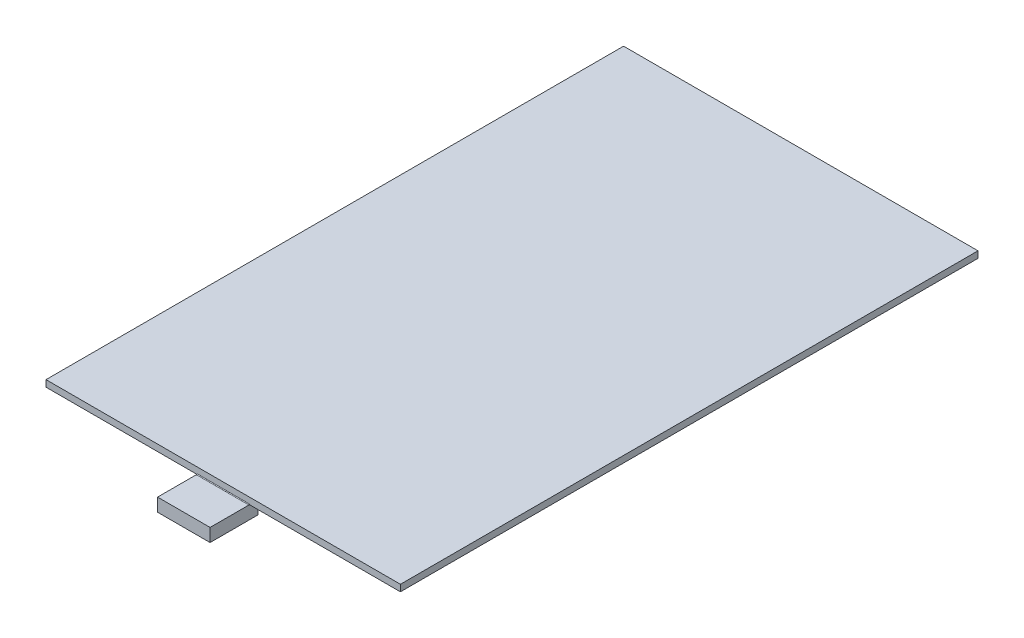
ISO-10303-21;
HEADER;
FILE_DESCRIPTION(('STEP AP214'),'2;1');
FILE_NAME('part.step','',(''),(''),'','','');
FILE_SCHEMA(('AUTOMOTIVE_DESIGN { 1 0 10303 214 1 1 1 1 }'));
ENDSEC;
DATA;
#1=APPLICATION_CONTEXT('core data for automotive mechanical design processes');
#2=APPLICATION_PROTOCOL_DEFINITION('international standard','automotive_design',2000,#1);
#3=PRODUCT_CONTEXT('',#1,'mechanical');
#4=PRODUCT('Part','Part','',(#3));
#5=PRODUCT_RELATED_PRODUCT_CATEGORY('part','',(#4));
#6=PRODUCT_DEFINITION_FORMATION('','',#4);
#7=PRODUCT_DEFINITION_CONTEXT('part definition',#1,'design');
#8=PRODUCT_DEFINITION('design','',#6,#7);
#9=PRODUCT_DEFINITION_SHAPE('','',#8);
#10=(LENGTH_UNIT() NAMED_UNIT(*) SI_UNIT(.MILLI.,.METRE.));
#11=(NAMED_UNIT(*) PLANE_ANGLE_UNIT() SI_UNIT($,.RADIAN.));
#12=(NAMED_UNIT(*) SI_UNIT($,.STERADIAN.) SOLID_ANGLE_UNIT());
#13=UNCERTAINTY_MEASURE_WITH_UNIT(LENGTH_MEASURE(1.E-05),#10,'distance_accuracy_value','');
#14=(GEOMETRIC_REPRESENTATION_CONTEXT(3) GLOBAL_UNCERTAINTY_ASSIGNED_CONTEXT((#13)) GLOBAL_UNIT_ASSIGNED_CONTEXT((#10,
#11,#12)) REPRESENTATION_CONTEXT('',''));
#15=CARTESIAN_POINT('',(0.,0.,0.));
#16=DIRECTION('',(0.,0.,1.));
#17=DIRECTION('',(1.,0.,0.));
#18=AXIS2_PLACEMENT_3D('',#15,#16,#17);
#19=CARTESIAN_POINT('',(0.,0.,0.));
#20=DIRECTION('',(0.,1.,0.));
#21=DIRECTION('',(0.,0.,1.));
#22=AXIS2_PLACEMENT_3D('',#19,#20,#21);
#23=PLANE('',#22);
#24=DIRECTION('',(1.,0.,0.));
#25=VECTOR('',#24,1.);
#26=CARTESIAN_POINT('',(-27.,0.,44.));
#27=LINE('',#26,#25);
#28=CARTESIAN_POINT('',(4.1,0.,44.));
#29=VERTEX_POINT('',#28);
#30=CARTESIAN_POINT('',(27.,0.,44.));
#31=VERTEX_POINT('',#30);
#32=EDGE_CURVE('E173',#29,#31,#27,.T.);
#33=ORIENTED_EDGE('',*,*,#32,.F.);
#34=DIRECTION('',(0.,0.,1.));
#35=VECTOR('',#34,1.);
#36=CARTESIAN_POINT('',(4.1,0.,42.7));
#37=LINE('',#36,#35);
#38=CARTESIAN_POINT('',(4.1,0.,42.6));
#39=VERTEX_POINT('',#38);
#40=EDGE_CURVE('E206',#29,#39,#37,.F.);
#41=ORIENTED_EDGE('',*,*,#40,.T.);
#42=DIRECTION('',(1.,0.,0.));
#43=VECTOR('',#42,1.);
#44=CARTESIAN_POINT('',(-4.,0.,42.6000000000001));
#45=LINE('',#44,#43);
#46=CARTESIAN_POINT('',(-4.09999999999997,0.,42.6000000000001));
#47=VERTEX_POINT('',#46);
#48=EDGE_CURVE('E204',#39,#47,#45,.F.);
#49=ORIENTED_EDGE('',*,*,#48,.T.);
#50=DIRECTION('',(0.,0.,-1.));
#51=VECTOR('',#50,1.);
#52=CARTESIAN_POINT('',(-4.09999999999998,0.,44.));
#53=LINE('',#52,#51);
#54=CARTESIAN_POINT('',(-4.09999999999998,0.,44.));
#55=VERTEX_POINT('',#54);
#56=EDGE_CURVE('E202',#47,#55,#53,.F.);
#57=ORIENTED_EDGE('',*,*,#56,.T.);
#58=CARTESIAN_POINT('',(-27.,0.,44.));
#59=VERTEX_POINT('',#58);
#60=EDGE_CURVE('E163',#59,#55,#27,.T.);
#61=ORIENTED_EDGE('',*,*,#60,.F.);
#62=DIRECTION('',(0.,0.,1.));
#63=VECTOR('',#62,1.);
#64=CARTESIAN_POINT('',(-27.,0.,-44.));
#65=LINE('',#64,#63);
#66=CARTESIAN_POINT('',(-27.,0.,-44.));
#67=VERTEX_POINT('',#66);
#68=EDGE_CURVE('E171',#67,#59,#65,.T.);
#69=ORIENTED_EDGE('',*,*,#68,.F.);
#70=DIRECTION('',(-1.,0.,0.));
#71=VECTOR('',#70,1.);
#72=CARTESIAN_POINT('',(-27.,0.,-44.));
#73=LINE('',#72,#71);
#74=CARTESIAN_POINT('',(27.,0.,-44.));
#75=VERTEX_POINT('',#74);
#76=EDGE_CURVE('E153',#75,#67,#73,.T.);
#77=ORIENTED_EDGE('',*,*,#76,.F.);
#78=DIRECTION('',(0.,0.,-1.));
#79=VECTOR('',#78,1.);
#80=CARTESIAN_POINT('',(27.,0.,-44.));
#81=LINE('',#80,#79);
#82=EDGE_CURVE('E150',#31,#75,#81,.T.);
#83=ORIENTED_EDGE('',*,*,#82,.F.);
#84=EDGE_LOOP('',(#33,#41,#49,#57,#61,#69,#77,#83));
#85=FACE_BOUND('',#84,.T.);
#86=ADVANCED_FACE('F34',(#85),#23,.F.);
#87=CARTESIAN_POINT('',(27.,1.,-44.));
#88=DIRECTION('',(-1.,0.,0.));
#89=DIRECTION('',(0.,0.,1.));
#90=AXIS2_PLACEMENT_3D('',#87,#88,#89);
#91=PLANE('',#90);
#92=ORIENTED_EDGE('',*,*,#82,.T.);
#93=DIRECTION('',(0.,-1.,0.));
#94=VECTOR('',#93,1.);
#95=CARTESIAN_POINT('',(27.,1.,-44.));
#96=LINE('',#95,#94);
#97=CARTESIAN_POINT('',(27.,1.,-44.));
#98=VERTEX_POINT('',#97);
#99=EDGE_CURVE('E184',#98,#75,#96,.T.);
#100=ORIENTED_EDGE('',*,*,#99,.F.);
#101=DIRECTION('',(0.,0.,-1.));
#102=VECTOR('',#101,1.);
#103=CARTESIAN_POINT('',(27.,1.,-44.));
#104=LINE('',#103,#102);
#105=CARTESIAN_POINT('',(27.,1.,44.));
#106=VERTEX_POINT('',#105);
#107=EDGE_CURVE('E159',#106,#98,#104,.T.);
#108=ORIENTED_EDGE('',*,*,#107,.F.);
#109=DIRECTION('',(0.,-1.,0.));
#110=VECTOR('',#109,1.);
#111=CARTESIAN_POINT('',(27.,1.,44.));
#112=LINE('',#111,#110);
#113=EDGE_CURVE('E168',#106,#31,#112,.T.);
#114=ORIENTED_EDGE('',*,*,#113,.T.);
#115=EDGE_LOOP('',(#92,#100,#108,#114));
#116=FACE_BOUND('',#115,.T.);
#117=ADVANCED_FACE('F264',(#116),#91,.F.);
#118=CARTESIAN_POINT('',(-27.,1.,-44.));
#119=DIRECTION('',(0.,0.,1.));
#120=DIRECTION('',(1.,0.,0.));
#121=AXIS2_PLACEMENT_3D('',#118,#119,#120);
#122=PLANE('',#121);
#123=ORIENTED_EDGE('',*,*,#76,.T.);
#124=DIRECTION('',(0.,-1.,0.));
#125=VECTOR('',#124,1.);
#126=CARTESIAN_POINT('',(-27.,1.,-44.));
#127=LINE('',#126,#125);
#128=CARTESIAN_POINT('',(-27.,1.,-44.));
#129=VERTEX_POINT('',#128);
#130=EDGE_CURVE('E181',#129,#67,#127,.T.);
#131=ORIENTED_EDGE('',*,*,#130,.F.);
#132=DIRECTION('',(-1.,0.,0.));
#133=VECTOR('',#132,1.);
#134=CARTESIAN_POINT('',(-27.,1.,-44.));
#135=LINE('',#134,#133);
#136=EDGE_CURVE('E162',#98,#129,#135,.T.);
#137=ORIENTED_EDGE('',*,*,#136,.F.);
#138=ORIENTED_EDGE('',*,*,#99,.T.);
#139=EDGE_LOOP('',(#123,#131,#137,#138));
#140=FACE_BOUND('',#139,.T.);
#141=ADVANCED_FACE('F275',(#140),#122,.F.);
#142=CARTESIAN_POINT('',(-27.,1.,-44.));
#143=DIRECTION('',(1.,0.,0.));
#144=DIRECTION('',(0.,0.,-1.));
#145=AXIS2_PLACEMENT_3D('',#142,#143,#144);
#146=PLANE('',#145);
#147=ORIENTED_EDGE('',*,*,#68,.T.);
#148=DIRECTION('',(0.,-1.,0.));
#149=VECTOR('',#148,1.);
#150=CARTESIAN_POINT('',(-27.,1.,44.));
#151=LINE('',#150,#149);
#152=CARTESIAN_POINT('',(-27.,1.,44.));
#153=VERTEX_POINT('',#152);
#154=EDGE_CURVE('E178',#153,#59,#151,.T.);
#155=ORIENTED_EDGE('',*,*,#154,.F.);
#156=DIRECTION('',(0.,0.,1.));
#157=VECTOR('',#156,1.);
#158=CARTESIAN_POINT('',(-27.,1.,-44.));
#159=LINE('',#158,#157);
#160=EDGE_CURVE('E165',#129,#153,#159,.T.);
#161=ORIENTED_EDGE('',*,*,#160,.F.);
#162=ORIENTED_EDGE('',*,*,#130,.T.);
#163=EDGE_LOOP('',(#147,#155,#161,#162));
#164=FACE_BOUND('',#163,.T.);
#165=ADVANCED_FACE('F273',(#164),#146,.F.);
#166=CARTESIAN_POINT('',(-27.,1.,44.));
#167=DIRECTION('',(0.,0.,-1.));
#168=DIRECTION('',(-1.,0.,0.));
#169=AXIS2_PLACEMENT_3D('',#166,#167,#168);
#170=PLANE('',#169);
#171=DIRECTION('',(1.,0.,0.));
#172=VECTOR('',#171,1.);
#173=CARTESIAN_POINT('',(-27.,0.1,44.));
#174=LINE('',#173,#172);
#175=CARTESIAN_POINT('',(-3.99999999999998,0.1,44.));
#176=VERTEX_POINT('',#175);
#177=CARTESIAN_POINT('',(4.,0.1,44.));
#178=VERTEX_POINT('',#177);
#179=EDGE_CURVE('E188',#176,#178,#174,.T.);
#180=ORIENTED_EDGE('',*,*,#179,.T.);
#181=DIRECTION('',(0.,-1.,0.));
#182=VECTOR('',#181,1.);
#183=CARTESIAN_POINT('',(4.,-2.,44.));
#184=LINE('',#183,#182);
#185=CARTESIAN_POINT('',(4.,-0.1,44.));
#186=VERTEX_POINT('',#185);
#187=EDGE_CURVE('E191',#178,#186,#184,.T.);
#188=ORIENTED_EDGE('',*,*,#187,.T.);
#189=CARTESIAN_POINT('',(4.1,-0.1,44.));
#190=DIRECTION('',(0.,0.,-1.));
#191=DIRECTION('',(-1.,0.,0.));
#192=AXIS2_PLACEMENT_3D('',#189,#190,#191);
#193=CIRCLE('',#192,0.1);
#194=EDGE_CURVE('E43',#186,#29,#193,.T.);
#195=ORIENTED_EDGE('',*,*,#194,.T.);
#196=ORIENTED_EDGE('',*,*,#32,.T.);
#197=ORIENTED_EDGE('',*,*,#113,.F.);
#198=DIRECTION('',(1.,0.,0.));
#199=VECTOR('',#198,1.);
#200=CARTESIAN_POINT('',(-27.,1.,44.));
#201=LINE('',#200,#199);
#202=EDGE_CURVE('E167',#153,#106,#201,.T.);
#203=ORIENTED_EDGE('',*,*,#202,.F.);
#204=ORIENTED_EDGE('',*,*,#154,.T.);
#205=ORIENTED_EDGE('',*,*,#60,.T.);
#206=CARTESIAN_POINT('',(-4.09999999999998,-0.1,44.));
#207=DIRECTION('',(0.,0.,-1.));
#208=DIRECTION('',(-1.,0.,0.));
#209=AXIS2_PLACEMENT_3D('',#206,#207,#208);
#210=CIRCLE('',#209,0.1);
#211=CARTESIAN_POINT('',(-3.99999999999998,-0.1,44.));
#212=VERTEX_POINT('',#211);
#213=EDGE_CURVE('E11',#55,#212,#210,.T.);
#214=ORIENTED_EDGE('',*,*,#213,.T.);
#215=DIRECTION('',(0.,1.,0.));
#216=VECTOR('',#215,1.);
#217=CARTESIAN_POINT('',(-3.99999999999998,-2.,44.));
#218=LINE('',#217,#216);
#219=EDGE_CURVE('E51',#212,#176,#218,.T.);
#220=ORIENTED_EDGE('',*,*,#219,.T.);
#221=EDGE_LOOP('',(#180,#188,#195,#196,#197,#203,#204,#205,#214,#220));
#222=FACE_BOUND('',#221,.T.);
#223=ADVANCED_FACE('F248',(#222),#170,.F.);
#224=CARTESIAN_POINT('',(0.,1.,0.));
#225=DIRECTION('',(0.,1.,0.));
#226=DIRECTION('',(0.,0.,1.));
#227=AXIS2_PLACEMENT_3D('',#224,#225,#226);
#228=PLANE('',#227);
#229=ORIENTED_EDGE('',*,*,#107,.T.);
#230=ORIENTED_EDGE('',*,*,#136,.T.);
#231=ORIENTED_EDGE('',*,*,#160,.T.);
#232=ORIENTED_EDGE('',*,*,#202,.T.);
#233=EDGE_LOOP('',(#229,#230,#231,#232));
#234=FACE_BOUND('',#233,.T.);
#235=ADVANCED_FACE('F269',(#234),#228,.T.);
#236=CARTESIAN_POINT('',(0.,0.,0.));
#237=DIRECTION('',(0.,1.,0.));
#238=DIRECTION('',(0.,0.,1.));
#239=AXIS2_PLACEMENT_3D('',#236,#237,#238);
#240=PLANE('',#239);
#241=DIRECTION('',(0.,0.,1.));
#242=VECTOR('',#241,1.);
#243=CARTESIAN_POINT('',(4.,0.,50.));
#244=LINE('',#243,#242);
#245=CARTESIAN_POINT('',(4.,0.,44.1));
#246=VERTEX_POINT('',#245);
#247=CARTESIAN_POINT('',(4.,0.,50.));
#248=VERTEX_POINT('',#247);
#249=EDGE_CURVE('E218',#246,#248,#244,.T.);
#250=ORIENTED_EDGE('',*,*,#249,.F.);
#251=DIRECTION('',(1.,0.,0.));
#252=VECTOR('',#251,1.);
#253=CARTESIAN_POINT('',(0.,0.,44.1));
#254=LINE('',#253,#252);
#255=CARTESIAN_POINT('',(-3.99999999999998,0.,44.1));
#256=VERTEX_POINT('',#255);
#257=EDGE_CURVE('E193',#246,#256,#254,.F.);
#258=ORIENTED_EDGE('',*,*,#257,.T.);
#259=DIRECTION('',(0.,0.,-1.));
#260=VECTOR('',#259,1.);
#261=CARTESIAN_POINT('',(-3.99999999999998,0.,44.0000000000001));
#262=LINE('',#261,#260);
#263=CARTESIAN_POINT('',(-4.,0.,50.));
#264=VERTEX_POINT('',#263);
#265=EDGE_CURVE('E147',#264,#256,#262,.T.);
#266=ORIENTED_EDGE('',*,*,#265,.F.);
#267=DIRECTION('',(-1.,0.,0.));
#268=VECTOR('',#267,1.);
#269=CARTESIAN_POINT('',(-4.,0.,50.));
#270=LINE('',#269,#268);
#271=EDGE_CURVE('E222',#248,#264,#270,.T.);
#272=ORIENTED_EDGE('',*,*,#271,.F.);
#273=EDGE_LOOP('',(#250,#258,#266,#272));
#274=FACE_BOUND('',#273,.T.);
#275=ADVANCED_FACE('F240',(#274),#240,.T.);
#276=CARTESIAN_POINT('',(-4.,-2.,42.7000000000001));
#277=DIRECTION('',(0.,0.,1.));
#278=DIRECTION('',(1.,0.,0.));
#279=AXIS2_PLACEMENT_3D('',#276,#277,#278);
#280=PLANE('',#279);
#281=DIRECTION('',(0.,1.,0.));
#282=VECTOR('',#281,1.);
#283=CARTESIAN_POINT('',(-4.,-2.,42.7000000000001));
#284=LINE('',#283,#282);
#285=CARTESIAN_POINT('',(-4.,-2.,42.7000000000001));
#286=VERTEX_POINT('',#285);
#287=CARTESIAN_POINT('',(-4.,-0.1,42.7000000000001));
#288=VERTEX_POINT('',#287);
#289=EDGE_CURVE('E132',#286,#288,#284,.T.);
#290=ORIENTED_EDGE('',*,*,#289,.T.);
#291=DIRECTION('',(1.,0.,0.));
#292=VECTOR('',#291,1.);
#293=CARTESIAN_POINT('',(4.,-0.1,42.7));
#294=LINE('',#293,#292);
#295=CARTESIAN_POINT('',(4.,-0.1,42.7));
#296=VERTEX_POINT('',#295);
#297=EDGE_CURVE('E208',#288,#296,#294,.T.);
#298=ORIENTED_EDGE('',*,*,#297,.T.);
#299=DIRECTION('',(0.,1.,0.));
#300=VECTOR('',#299,1.);
#301=CARTESIAN_POINT('',(4.,-2.,42.7));
#302=LINE('',#301,#300);
#303=CARTESIAN_POINT('',(4.,-2.,42.7));
#304=VERTEX_POINT('',#303);
#305=EDGE_CURVE('E135',#304,#296,#302,.T.);
#306=ORIENTED_EDGE('',*,*,#305,.F.);
#307=DIRECTION('',(1.,0.,0.));
#308=VECTOR('',#307,1.);
#309=CARTESIAN_POINT('',(-4.,-2.,42.7000000000001));
#310=LINE('',#309,#308);
#311=EDGE_CURVE('E129',#286,#304,#310,.T.);
#312=ORIENTED_EDGE('',*,*,#311,.F.);
#313=EDGE_LOOP('',(#290,#298,#306,#312));
#314=FACE_BOUND('',#313,.T.);
#315=ADVANCED_FACE('F131',(#314),#280,.F.);
#316=CARTESIAN_POINT('',(4.,-2.,50.));
#317=DIRECTION('',(-1.,0.,0.));
#318=DIRECTION('',(0.,0.,1.));
#319=AXIS2_PLACEMENT_3D('',#316,#317,#318);
#320=PLANE('',#319);
#321=ORIENTED_EDGE('',*,*,#305,.T.);
#322=DIRECTION('',(0.,0.,1.));
#323=VECTOR('',#322,1.);
#324=CARTESIAN_POINT('',(4.,-0.1,44.));
#325=LINE('',#324,#323);
#326=EDGE_CURVE('E199',#296,#186,#325,.T.);
#327=ORIENTED_EDGE('',*,*,#326,.T.);
#328=ORIENTED_EDGE('',*,*,#187,.F.);
#329=CARTESIAN_POINT('',(4.,0.1,44.1));
#330=DIRECTION('',(-1.,0.,0.));
#331=DIRECTION('',(0.,0.,1.));
#332=AXIS2_PLACEMENT_3D('',#329,#330,#331);
#333=CIRCLE('',#332,0.1);
#334=EDGE_CURVE('E195',#178,#246,#333,.T.);
#335=ORIENTED_EDGE('',*,*,#334,.T.);
#336=ORIENTED_EDGE('',*,*,#249,.T.);
#337=DIRECTION('',(0.,1.,0.));
#338=VECTOR('',#337,1.);
#339=CARTESIAN_POINT('',(4.,-2.,50.));
#340=LINE('',#339,#338);
#341=CARTESIAN_POINT('',(4.,-2.,50.));
#342=VERTEX_POINT('',#341);
#343=EDGE_CURVE('E155',#342,#248,#340,.T.);
#344=ORIENTED_EDGE('',*,*,#343,.F.);
#345=DIRECTION('',(0.,0.,1.));
#346=VECTOR('',#345,1.);
#347=CARTESIAN_POINT('',(4.,-2.,42.7));
#348=LINE('',#347,#346);
#349=EDGE_CURVE('E138',#304,#342,#348,.T.);
#350=ORIENTED_EDGE('',*,*,#349,.F.);
#351=EDGE_LOOP('',(#321,#327,#328,#335,#336,#344,#350));
#352=FACE_BOUND('',#351,.T.);
#353=ADVANCED_FACE('F255',(#352),#320,.F.);
#354=CARTESIAN_POINT('',(-4.,-2.,50.));
#355=DIRECTION('',(0.,0.,-1.));
#356=DIRECTION('',(-1.,0.,0.));
#357=AXIS2_PLACEMENT_3D('',#354,#355,#356);
#358=PLANE('',#357);
#359=ORIENTED_EDGE('',*,*,#271,.T.);
#360=DIRECTION('',(0.,1.,0.));
#361=VECTOR('',#360,1.);
#362=CARTESIAN_POINT('',(-4.,-2.,50.));
#363=LINE('',#362,#361);
#364=CARTESIAN_POINT('',(-4.,-2.,50.));
#365=VERTEX_POINT('',#364);
#366=EDGE_CURVE('E234',#365,#264,#363,.T.);
#367=ORIENTED_EDGE('',*,*,#366,.F.);
#368=DIRECTION('',(-1.,0.,0.));
#369=VECTOR('',#368,1.);
#370=CARTESIAN_POINT('',(-4.,-2.,50.));
#371=LINE('',#370,#369);
#372=EDGE_CURVE('E144',#342,#365,#371,.T.);
#373=ORIENTED_EDGE('',*,*,#372,.F.);
#374=ORIENTED_EDGE('',*,*,#343,.T.);
#375=EDGE_LOOP('',(#359,#367,#373,#374));
#376=FACE_BOUND('',#375,.T.);
#377=ADVANCED_FACE('F237',(#376),#358,.F.);
#378=CARTESIAN_POINT('',(-3.99999999999998,-2.,44.0000000000001));
#379=DIRECTION('',(1.,0.,0.));
#380=DIRECTION('',(0.,0.,-1.));
#381=AXIS2_PLACEMENT_3D('',#378,#379,#380);
#382=PLANE('',#381);
#383=ORIENTED_EDGE('',*,*,#219,.F.);
#384=DIRECTION('',(0.,0.,-1.));
#385=VECTOR('',#384,1.);
#386=CARTESIAN_POINT('',(-3.99999999999997,-0.1,42.7000000000001));
#387=LINE('',#386,#385);
#388=EDGE_CURVE('E55',#212,#288,#387,.T.);
#389=ORIENTED_EDGE('',*,*,#388,.T.);
#390=ORIENTED_EDGE('',*,*,#289,.F.);
#391=DIRECTION('',(0.,0.,-1.));
#392=VECTOR('',#391,1.);
#393=CARTESIAN_POINT('',(-4.,-2.,42.7000000000001));
#394=LINE('',#393,#392);
#395=EDGE_CURVE('E139',#365,#286,#394,.T.);
#396=ORIENTED_EDGE('',*,*,#395,.F.);
#397=ORIENTED_EDGE('',*,*,#366,.T.);
#398=ORIENTED_EDGE('',*,*,#265,.T.);
#399=CARTESIAN_POINT('',(-3.99999999999998,0.1,44.1));
#400=DIRECTION('',(1.,0.,0.));
#401=DIRECTION('',(0.,0.,-1.));
#402=AXIS2_PLACEMENT_3D('',#399,#400,#401);
#403=CIRCLE('',#402,0.1);
#404=EDGE_CURVE('E197',#256,#176,#403,.T.);
#405=ORIENTED_EDGE('',*,*,#404,.T.);
#406=EDGE_LOOP('',(#383,#389,#390,#396,#397,#398,#405));
#407=FACE_BOUND('',#406,.T.);
#408=ADVANCED_FACE('F149',(#407),#382,.F.);
#409=CARTESIAN_POINT('',(0.,-2.,0.));
#410=DIRECTION('',(0.,1.,0.));
#411=DIRECTION('',(0.,0.,1.));
#412=AXIS2_PLACEMENT_3D('',#409,#410,#411);
#413=PLANE('',#412);
#414=ORIENTED_EDGE('',*,*,#395,.T.);
#415=ORIENTED_EDGE('',*,*,#311,.T.);
#416=ORIENTED_EDGE('',*,*,#349,.T.);
#417=ORIENTED_EDGE('',*,*,#372,.T.);
#418=EDGE_LOOP('',(#414,#415,#416,#417));
#419=FACE_BOUND('',#418,.T.);
#420=ADVANCED_FACE('F142',(#419),#413,.F.);
#421=CARTESIAN_POINT('',(-27.,0.1,44.1));
#422=DIRECTION('',(1.,0.,0.));
#423=DIRECTION('',(0.,0.,-1.));
#424=AXIS2_PLACEMENT_3D('',#421,#422,#423);
#425=CYLINDRICAL_SURFACE('',#424,0.1);
#426=ORIENTED_EDGE('',*,*,#404,.F.);
#427=ORIENTED_EDGE('',*,*,#257,.F.);
#428=ORIENTED_EDGE('',*,*,#334,.F.);
#429=ORIENTED_EDGE('',*,*,#179,.F.);
#430=EDGE_LOOP('',(#426,#427,#428,#429));
#431=FACE_BOUND('',#430,.T.);
#432=ADVANCED_FACE('F245',(#431),#425,.F.);
#433=CARTESIAN_POINT('',(-4.09999999999998,-0.1,44.0000000000001));
#434=DIRECTION('',(0.,0.,1.));
#435=DIRECTION('',(1.,0.,0.));
#436=AXIS2_PLACEMENT_3D('',#433,#434,#435);
#437=CYLINDRICAL_SURFACE('',#436,0.1);
#438=ORIENTED_EDGE('',*,*,#213,.F.);
#439=ORIENTED_EDGE('',*,*,#56,.F.);
#440=CARTESIAN_POINT('',(-4.09999999999997,-0.1,42.6000000000001));
#441=DIRECTION('',(-0.707106781186546,0.,0.707106781186549));
#442=DIRECTION('',(0.707106781186549,0.,0.707106781186546));
#443=AXIS2_PLACEMENT_3D('',#440,#441,#442);
#444=ELLIPSE('',#443,0.141421356237309,0.1);
#445=EDGE_CURVE('E38',#288,#47,#444,.T.);
#446=ORIENTED_EDGE('',*,*,#445,.F.);
#447=ORIENTED_EDGE('',*,*,#388,.F.);
#448=EDGE_LOOP('',(#438,#439,#446,#447));
#449=FACE_BOUND('',#448,.T.);
#450=ADVANCED_FACE('F36',(#449),#437,.F.);
#451=CARTESIAN_POINT('',(-4.,-0.1,42.6000000000001));
#452=DIRECTION('',(-1.,0.,0.));
#453=DIRECTION('',(0.,0.,1.));
#454=AXIS2_PLACEMENT_3D('',#451,#452,#453);
#455=CYLINDRICAL_SURFACE('',#454,0.1);
#456=ORIENTED_EDGE('',*,*,#445,.T.);
#457=ORIENTED_EDGE('',*,*,#48,.F.);
#458=CARTESIAN_POINT('',(4.1,-0.1,42.6));
#459=DIRECTION('',(-0.70710678118655,0.,-0.707106781186545));
#460=DIRECTION('',(-0.707106781186545,0.,0.70710678118655));
#461=AXIS2_PLACEMENT_3D('',#458,#459,#460);
#462=ELLIPSE('',#461,0.14142135623731,0.1);
#463=EDGE_CURVE('E211',#296,#39,#462,.T.);
#464=ORIENTED_EDGE('',*,*,#463,.F.);
#465=ORIENTED_EDGE('',*,*,#297,.F.);
#466=EDGE_LOOP('',(#456,#457,#464,#465));
#467=FACE_BOUND('',#466,.T.);
#468=ADVANCED_FACE('F254',(#467),#455,.F.);
#469=CARTESIAN_POINT('',(4.1,-0.1,50.));
#470=DIRECTION('',(0.,0.,-1.));
#471=DIRECTION('',(-1.,0.,0.));
#472=AXIS2_PLACEMENT_3D('',#469,#470,#471);
#473=CYLINDRICAL_SURFACE('',#472,0.1);
#474=ORIENTED_EDGE('',*,*,#463,.T.);
#475=ORIENTED_EDGE('',*,*,#40,.F.);
#476=ORIENTED_EDGE('',*,*,#194,.F.);
#477=ORIENTED_EDGE('',*,*,#326,.F.);
#478=EDGE_LOOP('',(#474,#475,#476,#477));
#479=FACE_BOUND('',#478,.T.);
#480=ADVANCED_FACE('F256',(#479),#473,.F.);
#481=CLOSED_SHELL('',(#86,#117,#141,#165,#223,#235,#275,#315,#353,#377,#408,#420,#432,#450,#468,#480));
#482=MANIFOLD_SOLID_BREP('B2',#481);
#483=ADVANCED_BREP_SHAPE_REPRESENTATION('',(#18,#482),#14);
#484=SHAPE_DEFINITION_REPRESENTATION(#9,#483);
ENDSEC;
END-ISO-10303-21;
